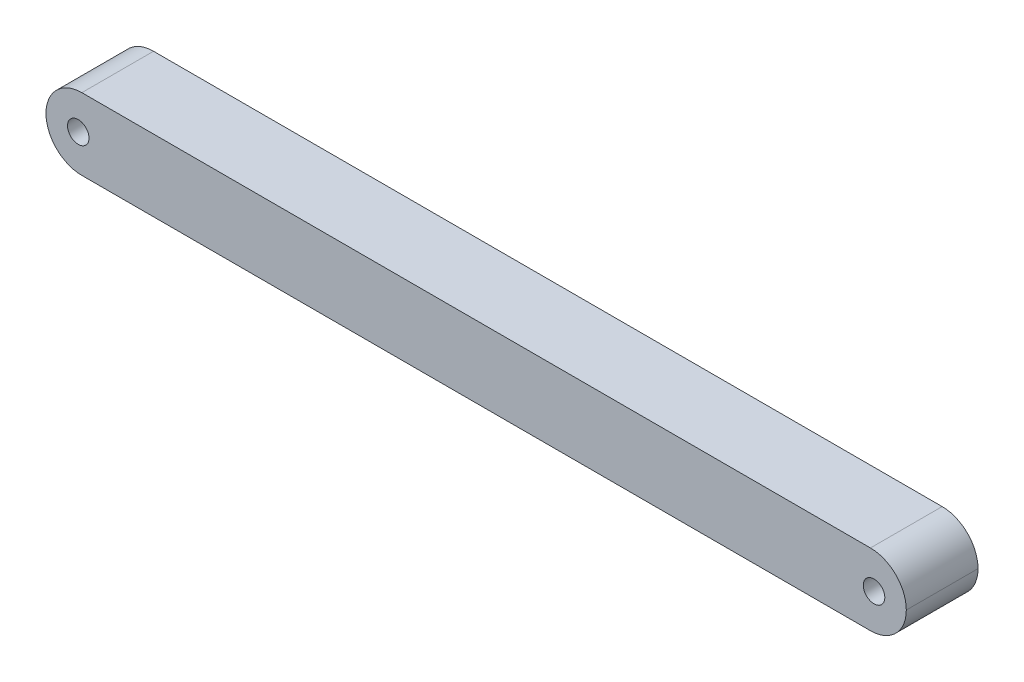
ISO-10303-21;
HEADER;
FILE_DESCRIPTION(('STEP AP214'),'2;1');
FILE_NAME('part.step','',(''),(''),'','','');
FILE_SCHEMA(('AUTOMOTIVE_DESIGN { 1 0 10303 214 1 1 1 1 }'));
ENDSEC;
DATA;
#1=APPLICATION_CONTEXT('core data for automotive mechanical design processes');
#2=APPLICATION_PROTOCOL_DEFINITION('international standard','automotive_design',2000,#1);
#3=PRODUCT_CONTEXT('',#1,'mechanical');
#4=PRODUCT('Part','Part','',(#3));
#5=PRODUCT_RELATED_PRODUCT_CATEGORY('part','',(#4));
#6=PRODUCT_DEFINITION_FORMATION('','',#4);
#7=PRODUCT_DEFINITION_CONTEXT('part definition',#1,'design');
#8=PRODUCT_DEFINITION('design','',#6,#7);
#9=PRODUCT_DEFINITION_SHAPE('','',#8);
#10=(LENGTH_UNIT() NAMED_UNIT(*) SI_UNIT(.MILLI.,.METRE.));
#11=(NAMED_UNIT(*) PLANE_ANGLE_UNIT() SI_UNIT($,.RADIAN.));
#12=(NAMED_UNIT(*) SI_UNIT($,.STERADIAN.) SOLID_ANGLE_UNIT());
#13=UNCERTAINTY_MEASURE_WITH_UNIT(LENGTH_MEASURE(1.E-05),#10,'distance_accuracy_value','');
#14=(GEOMETRIC_REPRESENTATION_CONTEXT(3) GLOBAL_UNCERTAINTY_ASSIGNED_CONTEXT((#13)) GLOBAL_UNIT_ASSIGNED_CONTEXT((#10,
#11,#12)) REPRESENTATION_CONTEXT('',''));
#15=CARTESIAN_POINT('',(0.,0.,0.));
#16=DIRECTION('',(0.,0.,1.));
#17=DIRECTION('',(1.,0.,0.));
#18=AXIS2_PLACEMENT_3D('',#15,#16,#17);
#19=CARTESIAN_POINT('',(5.,5.,10.));
#20=DIRECTION('',(0.,0.,-1.));
#21=DIRECTION('',(-1.,0.,0.));
#22=AXIS2_PLACEMENT_3D('',#19,#20,#21);
#23=CYLINDRICAL_SURFACE('',#22,5.);
#24=DIRECTION('',(0.,0.,1.));
#25=VECTOR('',#24,1.);
#26=CARTESIAN_POINT('',(0.,5.,10.));
#27=LINE('',#26,#25);
#28=CARTESIAN_POINT('',(0.,5.,10.));
#29=VERTEX_POINT('',#28);
#30=CARTESIAN_POINT('',(0.,5.,0.));
#31=VERTEX_POINT('',#30);
#32=EDGE_CURVE('E154',#29,#31,#27,.F.);
#33=ORIENTED_EDGE('',*,*,#32,.T.);
#34=CARTESIAN_POINT('',(5.,5.,0.));
#35=DIRECTION('',(0.,0.,1.));
#36=DIRECTION('',(1.,0.,0.));
#37=AXIS2_PLACEMENT_3D('',#34,#35,#36);
#38=CIRCLE('',#37,5.);
#39=CARTESIAN_POINT('',(5.,0.,0.));
#40=VERTEX_POINT('',#39);
#41=EDGE_CURVE('E55',#40,#31,#38,.F.);
#42=ORIENTED_EDGE('',*,*,#41,.F.);
#43=DIRECTION('',(0.,0.,1.));
#44=VECTOR('',#43,1.);
#45=CARTESIAN_POINT('',(5.,0.,10.));
#46=LINE('',#45,#44);
#47=CARTESIAN_POINT('',(5.,0.,10.));
#48=VERTEX_POINT('',#47);
#49=EDGE_CURVE('E162',#48,#40,#46,.F.);
#50=ORIENTED_EDGE('',*,*,#49,.F.);
#51=CARTESIAN_POINT('',(5.,5.,10.));
#52=DIRECTION('',(0.,0.,1.));
#53=DIRECTION('',(1.,0.,0.));
#54=AXIS2_PLACEMENT_3D('',#51,#52,#53);
#55=CIRCLE('',#54,5.);
#56=EDGE_CURVE('E11',#29,#48,#55,.T.);
#57=ORIENTED_EDGE('',*,*,#56,.F.);
#58=EDGE_LOOP('',(#33,#42,#50,#57));
#59=FACE_BOUND('',#58,.T.);
#60=ADVANCED_FACE('F47',(#59),#23,.T.);
#61=CARTESIAN_POINT('',(5.,5.,10.));
#62=DIRECTION('',(0.,0.,1.));
#63=DIRECTION('',(1.,0.,0.));
#64=AXIS2_PLACEMENT_3D('',#61,#62,#63);
#65=CYLINDRICAL_SURFACE('',#64,5.);
#66=DIRECTION('',(0.,0.,1.));
#67=VECTOR('',#66,1.);
#68=CARTESIAN_POINT('',(5.,10.,10.));
#69=LINE('',#68,#67);
#70=CARTESIAN_POINT('',(5.,10.,0.));
#71=VERTEX_POINT('',#70);
#72=CARTESIAN_POINT('',(5.,10.,10.));
#73=VERTEX_POINT('',#72);
#74=EDGE_CURVE('E151',#71,#73,#69,.T.);
#75=ORIENTED_EDGE('',*,*,#74,.F.);
#76=CARTESIAN_POINT('',(5.,5.,0.));
#77=DIRECTION('',(0.,0.,1.));
#78=DIRECTION('',(1.,0.,0.));
#79=AXIS2_PLACEMENT_3D('',#76,#77,#78);
#80=CIRCLE('',#79,5.);
#81=EDGE_CURVE('E106',#31,#71,#80,.F.);
#82=ORIENTED_EDGE('',*,*,#81,.F.);
#83=ORIENTED_EDGE('',*,*,#32,.F.);
#84=CARTESIAN_POINT('',(5.,5.,10.));
#85=DIRECTION('',(0.,0.,1.));
#86=DIRECTION('',(1.,0.,0.));
#87=AXIS2_PLACEMENT_3D('',#84,#85,#86);
#88=CIRCLE('',#87,5.);
#89=EDGE_CURVE('E159',#73,#29,#88,.T.);
#90=ORIENTED_EDGE('',*,*,#89,.F.);
#91=EDGE_LOOP('',(#75,#82,#83,#90));
#92=FACE_BOUND('',#91,.T.);
#93=ADVANCED_FACE('F167',(#92),#65,.T.);
#94=CARTESIAN_POINT('',(115.,5.,10.));
#95=DIRECTION('',(0.,0.,-1.));
#96=DIRECTION('',(-1.,0.,0.));
#97=AXIS2_PLACEMENT_3D('',#94,#95,#96);
#98=CYLINDRICAL_SURFACE('',#97,5.);
#99=DIRECTION('',(0.,0.,-1.));
#100=VECTOR('',#99,1.);
#101=CARTESIAN_POINT('',(120.,5.,10.));
#102=LINE('',#101,#100);
#103=CARTESIAN_POINT('',(120.,5.,0.));
#104=VERTEX_POINT('',#103);
#105=CARTESIAN_POINT('',(120.,5.,10.));
#106=VERTEX_POINT('',#105);
#107=EDGE_CURVE('E121',#104,#106,#102,.F.);
#108=ORIENTED_EDGE('',*,*,#107,.T.);
#109=CARTESIAN_POINT('',(115.,5.,10.));
#110=DIRECTION('',(0.,0.,1.));
#111=DIRECTION('',(1.,0.,0.));
#112=AXIS2_PLACEMENT_3D('',#109,#110,#111);
#113=CIRCLE('',#112,5.);
#114=CARTESIAN_POINT('',(115.,0.,10.));
#115=VERTEX_POINT('',#114);
#116=EDGE_CURVE('E145',#115,#106,#113,.T.);
#117=ORIENTED_EDGE('',*,*,#116,.F.);
#118=DIRECTION('',(0.,0.,-1.));
#119=VECTOR('',#118,1.);
#120=CARTESIAN_POINT('',(115.,0.,10.));
#121=LINE('',#120,#119);
#122=CARTESIAN_POINT('',(115.,0.,0.));
#123=VERTEX_POINT('',#122);
#124=EDGE_CURVE('E123',#123,#115,#121,.F.);
#125=ORIENTED_EDGE('',*,*,#124,.F.);
#126=CARTESIAN_POINT('',(115.,5.,0.));
#127=DIRECTION('',(0.,0.,1.));
#128=DIRECTION('',(1.,0.,0.));
#129=AXIS2_PLACEMENT_3D('',#126,#127,#128);
#130=CIRCLE('',#129,5.);
#131=EDGE_CURVE('E148',#104,#123,#130,.F.);
#132=ORIENTED_EDGE('',*,*,#131,.F.);
#133=EDGE_LOOP('',(#108,#117,#125,#132));
#134=FACE_BOUND('',#133,.T.);
#135=ADVANCED_FACE('F189',(#134),#98,.T.);
#136=CARTESIAN_POINT('',(115.,5.,10.));
#137=DIRECTION('',(0.,0.,1.));
#138=DIRECTION('',(1.,0.,0.));
#139=AXIS2_PLACEMENT_3D('',#136,#137,#138);
#140=CYLINDRICAL_SURFACE('',#139,5.);
#141=DIRECTION('',(0.,0.,-1.));
#142=VECTOR('',#141,1.);
#143=CARTESIAN_POINT('',(115.,10.,10.));
#144=LINE('',#143,#142);
#145=CARTESIAN_POINT('',(115.,10.,10.));
#146=VERTEX_POINT('',#145);
#147=CARTESIAN_POINT('',(115.,10.,0.));
#148=VERTEX_POINT('',#147);
#149=EDGE_CURVE('E119',#146,#148,#144,.T.);
#150=ORIENTED_EDGE('',*,*,#149,.F.);
#151=CARTESIAN_POINT('',(115.,5.,10.));
#152=DIRECTION('',(0.,0.,1.));
#153=DIRECTION('',(1.,0.,0.));
#154=AXIS2_PLACEMENT_3D('',#151,#152,#153);
#155=CIRCLE('',#154,5.);
#156=EDGE_CURVE('E124',#106,#146,#155,.T.);
#157=ORIENTED_EDGE('',*,*,#156,.F.);
#158=ORIENTED_EDGE('',*,*,#107,.F.);
#159=CARTESIAN_POINT('',(115.,5.,0.));
#160=DIRECTION('',(0.,0.,1.));
#161=DIRECTION('',(1.,0.,0.));
#162=AXIS2_PLACEMENT_3D('',#159,#160,#161);
#163=CIRCLE('',#162,5.);
#164=EDGE_CURVE('E103',#148,#104,#163,.F.);
#165=ORIENTED_EDGE('',*,*,#164,.F.);
#166=EDGE_LOOP('',(#150,#157,#158,#165));
#167=FACE_BOUND('',#166,.T.);
#168=ADVANCED_FACE('F117',(#167),#140,.T.);
#169=CARTESIAN_POINT('',(0.,0.,10.));
#170=DIRECTION('',(0.,1.,0.));
#171=DIRECTION('',(0.,0.,1.));
#172=AXIS2_PLACEMENT_3D('',#169,#170,#171);
#173=PLANE('',#172);
#174=DIRECTION('',(1.,0.,0.));
#175=VECTOR('',#174,1.);
#176=CARTESIAN_POINT('',(0.,0.,10.));
#177=LINE('',#176,#175);
#178=EDGE_CURVE('E172',#48,#115,#177,.T.);
#179=ORIENTED_EDGE('',*,*,#178,.F.);
#180=ORIENTED_EDGE('',*,*,#49,.T.);
#181=DIRECTION('',(1.,0.,0.));
#182=VECTOR('',#181,1.);
#183=CARTESIAN_POINT('',(0.,0.,0.));
#184=LINE('',#183,#182);
#185=EDGE_CURVE('E113',#40,#123,#184,.T.);
#186=ORIENTED_EDGE('',*,*,#185,.T.);
#187=ORIENTED_EDGE('',*,*,#124,.T.);
#188=EDGE_LOOP('',(#179,#180,#186,#187));
#189=FACE_BOUND('',#188,.T.);
#190=ADVANCED_FACE('F185',(#189),#173,.F.);
#191=CARTESIAN_POINT('',(0.,10.,10.));
#192=DIRECTION('',(0.,1.,0.));
#193=DIRECTION('',(0.,0.,1.));
#194=AXIS2_PLACEMENT_3D('',#191,#192,#193);
#195=PLANE('',#194);
#196=DIRECTION('',(1.,0.,0.));
#197=VECTOR('',#196,1.);
#198=CARTESIAN_POINT('',(0.,10.,0.));
#199=LINE('',#198,#197);
#200=EDGE_CURVE('E97',#71,#148,#199,.T.);
#201=ORIENTED_EDGE('',*,*,#200,.F.);
#202=ORIENTED_EDGE('',*,*,#74,.T.);
#203=DIRECTION('',(1.,0.,0.));
#204=VECTOR('',#203,1.);
#205=CARTESIAN_POINT('',(0.,10.,10.));
#206=LINE('',#205,#204);
#207=EDGE_CURVE('E128',#73,#146,#206,.T.);
#208=ORIENTED_EDGE('',*,*,#207,.T.);
#209=ORIENTED_EDGE('',*,*,#149,.T.);
#210=EDGE_LOOP('',(#201,#202,#208,#209));
#211=FACE_BOUND('',#210,.T.);
#212=ADVANCED_FACE('F126',(#211),#195,.T.);
#213=CARTESIAN_POINT('',(115.5,5.,10.));
#214=DIRECTION('',(0.,0.,-1.));
#215=DIRECTION('',(-1.,0.,0.));
#216=AXIS2_PLACEMENT_3D('',#213,#214,#215);
#217=CYLINDRICAL_SURFACE('',#216,1.5);
#218=CARTESIAN_POINT('',(115.5,5.,10.));
#219=DIRECTION('',(0.,0.,1.));
#220=DIRECTION('',(1.,0.,0.));
#221=AXIS2_PLACEMENT_3D('',#218,#219,#220);
#222=CIRCLE('',#221,1.5);
#223=CARTESIAN_POINT('',(117.,5.,10.));
#224=VERTEX_POINT('',#223);
#225=EDGE_CURVE('E175',#224,#224,#222,.T.);
#226=ORIENTED_EDGE('',*,*,#225,.T.);
#227=EDGE_LOOP('',(#226));
#228=FACE_BOUND('',#227,.T.);
#229=CARTESIAN_POINT('',(115.5,5.,0.));
#230=DIRECTION('',(0.,0.,1.));
#231=DIRECTION('',(1.,0.,0.));
#232=AXIS2_PLACEMENT_3D('',#229,#230,#231);
#233=CIRCLE('',#232,1.5);
#234=CARTESIAN_POINT('',(117.,5.,0.));
#235=VERTEX_POINT('',#234);
#236=EDGE_CURVE('E179',#235,#235,#233,.T.);
#237=ORIENTED_EDGE('',*,*,#236,.F.);
#238=EDGE_LOOP('',(#237));
#239=FACE_BOUND('',#238,.T.);
#240=ADVANCED_FACE('F217',(#228,#239),#217,.F.);
#241=CARTESIAN_POINT('',(4.5,5.,10.));
#242=DIRECTION('',(0.,0.,-1.));
#243=DIRECTION('',(-1.,0.,0.));
#244=AXIS2_PLACEMENT_3D('',#241,#242,#243);
#245=CYLINDRICAL_SURFACE('',#244,1.5);
#246=CARTESIAN_POINT('',(4.5,5.,10.));
#247=DIRECTION('',(0.,0.,1.));
#248=DIRECTION('',(1.,0.,0.));
#249=AXIS2_PLACEMENT_3D('',#246,#247,#248);
#250=CIRCLE('',#249,1.5);
#251=CARTESIAN_POINT('',(6.,5.,10.));
#252=VERTEX_POINT('',#251);
#253=EDGE_CURVE('E131',#252,#252,#250,.T.);
#254=ORIENTED_EDGE('',*,*,#253,.T.);
#255=EDGE_LOOP('',(#254));
#256=FACE_BOUND('',#255,.T.);
#257=CARTESIAN_POINT('',(4.5,5.,0.));
#258=DIRECTION('',(0.,0.,1.));
#259=DIRECTION('',(1.,0.,0.));
#260=AXIS2_PLACEMENT_3D('',#257,#258,#259);
#261=CIRCLE('',#260,1.5);
#262=CARTESIAN_POINT('',(6.,5.,0.));
#263=VERTEX_POINT('',#262);
#264=EDGE_CURVE('E112',#263,#263,#261,.T.);
#265=ORIENTED_EDGE('',*,*,#264,.F.);
#266=EDGE_LOOP('',(#265));
#267=FACE_BOUND('',#266,.T.);
#268=ADVANCED_FACE('F231',(#256,#267),#245,.F.);
#269=CARTESIAN_POINT('',(0.,0.,10.));
#270=DIRECTION('',(0.,0.,1.));
#271=DIRECTION('',(1.,0.,0.));
#272=AXIS2_PLACEMENT_3D('',#269,#270,#271);
#273=PLANE('',#272);
#274=ORIENTED_EDGE('',*,*,#225,.F.);
#275=EDGE_LOOP('',(#274));
#276=FACE_BOUND('',#275,.T.);
#277=ORIENTED_EDGE('',*,*,#89,.T.);
#278=ORIENTED_EDGE('',*,*,#56,.T.);
#279=ORIENTED_EDGE('',*,*,#178,.T.);
#280=ORIENTED_EDGE('',*,*,#116,.T.);
#281=ORIENTED_EDGE('',*,*,#156,.T.);
#282=ORIENTED_EDGE('',*,*,#207,.F.);
#283=EDGE_LOOP('',(#277,#278,#279,#280,#281,#282));
#284=FACE_BOUND('',#283,.T.);
#285=ORIENTED_EDGE('',*,*,#253,.F.);
#286=EDGE_LOOP('',(#285));
#287=FACE_BOUND('',#286,.T.);
#288=ADVANCED_FACE('F169',(#276,#284,#287),#273,.T.);
#289=CARTESIAN_POINT('',(0.,0.,0.));
#290=DIRECTION('',(0.,0.,1.));
#291=DIRECTION('',(1.,0.,0.));
#292=AXIS2_PLACEMENT_3D('',#289,#290,#291);
#293=PLANE('',#292);
#294=ORIENTED_EDGE('',*,*,#236,.T.);
#295=EDGE_LOOP('',(#294));
#296=FACE_BOUND('',#295,.T.);
#297=ORIENTED_EDGE('',*,*,#185,.F.);
#298=ORIENTED_EDGE('',*,*,#41,.T.);
#299=ORIENTED_EDGE('',*,*,#81,.T.);
#300=ORIENTED_EDGE('',*,*,#200,.T.);
#301=ORIENTED_EDGE('',*,*,#164,.T.);
#302=ORIENTED_EDGE('',*,*,#131,.T.);
#303=EDGE_LOOP('',(#297,#298,#299,#300,#301,#302));
#304=FACE_BOUND('',#303,.T.);
#305=ORIENTED_EDGE('',*,*,#264,.T.);
#306=EDGE_LOOP('',(#305));
#307=FACE_BOUND('',#306,.T.);
#308=ADVANCED_FACE('F100',(#296,#304,#307),#293,.F.);
#309=CLOSED_SHELL('',(#60,#93,#135,#168,#190,#212,#240,#268,#288,#308));
#310=MANIFOLD_SOLID_BREP('B2',#309);
#311=ADVANCED_BREP_SHAPE_REPRESENTATION('',(#18,#310),#14);
#312=SHAPE_DEFINITION_REPRESENTATION(#9,#311);
ENDSEC;
END-ISO-10303-21;
